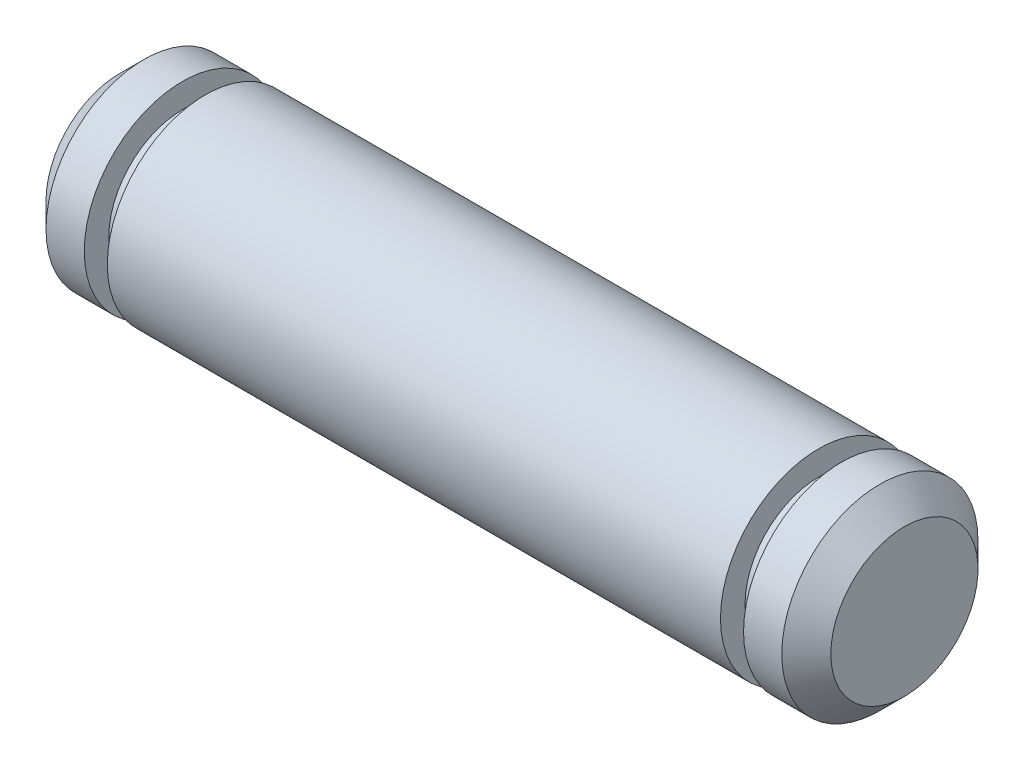
ISO-10303-21;
HEADER;
FILE_DESCRIPTION(('STEP AP214'),'2;1');
FILE_NAME('part.step','',(''),(''),'','','');
FILE_SCHEMA(('AUTOMOTIVE_DESIGN { 1 0 10303 214 1 1 1 1 }'));
ENDSEC;
DATA;
#1=APPLICATION_CONTEXT('core data for automotive mechanical design processes');
#2=APPLICATION_PROTOCOL_DEFINITION('international standard','automotive_design',2000,#1);
#3=PRODUCT_CONTEXT('',#1,'mechanical');
#4=PRODUCT('Part','Part','',(#3));
#5=PRODUCT_RELATED_PRODUCT_CATEGORY('part','',(#4));
#6=PRODUCT_DEFINITION_FORMATION('','',#4);
#7=PRODUCT_DEFINITION_CONTEXT('part definition',#1,'design');
#8=PRODUCT_DEFINITION('design','',#6,#7);
#9=PRODUCT_DEFINITION_SHAPE('','',#8);
#10=(LENGTH_UNIT() NAMED_UNIT(*) SI_UNIT(.MILLI.,.METRE.));
#11=(NAMED_UNIT(*) PLANE_ANGLE_UNIT() SI_UNIT($,.RADIAN.));
#12=(NAMED_UNIT(*) SI_UNIT($,.STERADIAN.) SOLID_ANGLE_UNIT());
#13=UNCERTAINTY_MEASURE_WITH_UNIT(LENGTH_MEASURE(1.E-05),#10,'distance_accuracy_value','');
#14=(GEOMETRIC_REPRESENTATION_CONTEXT(3) GLOBAL_UNCERTAINTY_ASSIGNED_CONTEXT((#13)) GLOBAL_UNIT_ASSIGNED_CONTEXT((#10,
#11,#12)) REPRESENTATION_CONTEXT('',''));
#15=CARTESIAN_POINT('',(0.,0.,0.));
#16=DIRECTION('',(0.,0.,1.));
#17=DIRECTION('',(1.,0.,0.));
#18=AXIS2_PLACEMENT_3D('',#15,#16,#17);
#19=CARTESIAN_POINT('',(16.,0.,0.));
#20=DIRECTION('',(-1.,0.,0.));
#21=DIRECTION('',(0.,0.,1.));
#22=AXIS2_PLACEMENT_3D('',#19,#20,#21);
#23=CYLINDRICAL_SURFACE('',#22,4.);
#24=CARTESIAN_POINT('',(12.5,0.,0.));
#25=DIRECTION('',(-1.,0.,0.));
#26=DIRECTION('',(0.,0.,1.));
#27=AXIS2_PLACEMENT_3D('',#24,#25,#26);
#28=CIRCLE('',#27,4.);
#29=CARTESIAN_POINT('',(12.5,0.,4.));
#30=VERTEX_POINT('',#29);
#31=EDGE_CURVE('E60',#30,#30,#28,.T.);
#32=ORIENTED_EDGE('',*,*,#31,.T.);
#33=EDGE_LOOP('',(#32));
#34=FACE_BOUND('',#33,.T.);
#35=CARTESIAN_POINT('',(-12.5,0.,0.));
#36=DIRECTION('',(-1.,0.,0.));
#37=DIRECTION('',(0.,0.,1.));
#38=AXIS2_PLACEMENT_3D('',#35,#36,#37);
#39=CIRCLE('',#38,4.);
#40=CARTESIAN_POINT('',(-12.5,0.,4.));
#41=VERTEX_POINT('',#40);
#42=EDGE_CURVE('E69',#41,#41,#39,.T.);
#43=ORIENTED_EDGE('',*,*,#42,.F.);
#44=EDGE_LOOP('',(#43));
#45=FACE_BOUND('',#44,.T.);
#46=ADVANCED_FACE('F31',(#34,#45),#23,.T.);
#47=CARTESIAN_POINT('',(12.5,4.,0.));
#48=DIRECTION('',(1.,0.,0.));
#49=DIRECTION('',(0.,0.,-1.));
#50=AXIS2_PLACEMENT_3D('',#47,#48,#49);
#51=PLANE('',#50);
#52=CARTESIAN_POINT('',(12.5,0.,0.));
#53=DIRECTION('',(-1.,0.,0.));
#54=DIRECTION('',(0.,0.,1.));
#55=AXIS2_PLACEMENT_3D('',#52,#53,#54);
#56=CIRCLE('',#55,3.);
#57=CARTESIAN_POINT('',(12.5,0.,3.));
#58=VERTEX_POINT('',#57);
#59=EDGE_CURVE('E51',#58,#58,#56,.T.);
#60=ORIENTED_EDGE('',*,*,#59,.T.);
#61=EDGE_LOOP('',(#60));
#62=FACE_BOUND('',#61,.T.);
#63=ORIENTED_EDGE('',*,*,#31,.F.);
#64=EDGE_LOOP('',(#63));
#65=FACE_BOUND('',#64,.T.);
#66=ADVANCED_FACE('F94',(#62,#65),#51,.T.);
#67=CARTESIAN_POINT('',(16.,0.,0.));
#68=DIRECTION('',(-1.,0.,0.));
#69=DIRECTION('',(0.,0.,1.));
#70=AXIS2_PLACEMENT_3D('',#67,#68,#69);
#71=CYLINDRICAL_SURFACE('',#70,3.);
#72=CARTESIAN_POINT('',(13.44,0.,0.));
#73=DIRECTION('',(-1.,0.,0.));
#74=DIRECTION('',(0.,0.,1.));
#75=AXIS2_PLACEMENT_3D('',#72,#73,#74);
#76=CIRCLE('',#75,3.);
#77=CARTESIAN_POINT('',(13.44,0.,3.));
#78=VERTEX_POINT('',#77);
#79=EDGE_CURVE('E54',#78,#78,#76,.T.);
#80=ORIENTED_EDGE('',*,*,#79,.T.);
#81=EDGE_LOOP('',(#80));
#82=FACE_BOUND('',#81,.T.);
#83=ORIENTED_EDGE('',*,*,#59,.F.);
#84=EDGE_LOOP('',(#83));
#85=FACE_BOUND('',#84,.T.);
#86=ADVANCED_FACE('F99',(#82,#85),#71,.T.);
#87=CARTESIAN_POINT('',(13.44,3.,0.));
#88=DIRECTION('',(-1.,0.,0.));
#89=DIRECTION('',(0.,0.,1.));
#90=AXIS2_PLACEMENT_3D('',#87,#88,#89);
#91=PLANE('',#90);
#92=CARTESIAN_POINT('',(13.44,0.,0.));
#93=DIRECTION('',(-1.,0.,0.));
#94=DIRECTION('',(0.,0.,1.));
#95=AXIS2_PLACEMENT_3D('',#92,#93,#94);
#96=CIRCLE('',#95,4.);
#97=CARTESIAN_POINT('',(13.44,0.,4.));
#98=VERTEX_POINT('',#97);
#99=EDGE_CURVE('E57',#98,#98,#96,.T.);
#100=ORIENTED_EDGE('',*,*,#99,.T.);
#101=EDGE_LOOP('',(#100));
#102=FACE_BOUND('',#101,.T.);
#103=ORIENTED_EDGE('',*,*,#79,.F.);
#104=EDGE_LOOP('',(#103));
#105=FACE_BOUND('',#104,.T.);
#106=ADVANCED_FACE('F157',(#102,#105),#91,.T.);
#107=CARTESIAN_POINT('',(16.,4.,0.));
#108=DIRECTION('',(-1.,0.,0.));
#109=DIRECTION('',(0.,0.,1.));
#110=AXIS2_PLACEMENT_3D('',#107,#108,#109);
#111=PLANE('',#110);
#112=CARTESIAN_POINT('',(16.,0.,0.));
#113=DIRECTION('',(-1.,0.,0.));
#114=DIRECTION('',(0.,0.,1.));
#115=AXIS2_PLACEMENT_3D('',#112,#113,#114);
#116=CIRCLE('',#115,3.);
#117=CARTESIAN_POINT('',(16.,0.,3.));
#118=VERTEX_POINT('',#117);
#119=EDGE_CURVE('E10',#118,#118,#116,.T.);
#120=ORIENTED_EDGE('',*,*,#119,.F.);
#121=EDGE_LOOP('',(#120));
#122=FACE_BOUND('',#121,.T.);
#123=ADVANCED_FACE('F161',(#122),#111,.F.);
#124=CARTESIAN_POINT('',(15.,0.,0.));
#125=DIRECTION('',(-1.,0.,0.));
#126=DIRECTION('',(0.,0.,1.));
#127=AXIS2_PLACEMENT_3D('',#124,#125,#126);
#128=CONICAL_SURFACE('',#127,4.,0.785398163397448);
#129=ORIENTED_EDGE('',*,*,#119,.T.);
#130=EDGE_LOOP('',(#129));
#131=FACE_BOUND('',#130,.T.);
#132=CARTESIAN_POINT('',(15.,0.,0.));
#133=DIRECTION('',(-1.,0.,0.));
#134=DIRECTION('',(0.,0.,1.));
#135=AXIS2_PLACEMENT_3D('',#132,#133,#134);
#136=CIRCLE('',#135,4.);
#137=CARTESIAN_POINT('',(15.,0.,4.));
#138=VERTEX_POINT('',#137);
#139=EDGE_CURVE('E38',#138,#138,#136,.T.);
#140=ORIENTED_EDGE('',*,*,#139,.F.);
#141=EDGE_LOOP('',(#140));
#142=FACE_BOUND('',#141,.T.);
#143=ADVANCED_FACE('F91',(#131,#142),#128,.T.);
#144=ORIENTED_EDGE('',*,*,#139,.T.);
#145=EDGE_LOOP('',(#144));
#146=FACE_BOUND('',#145,.T.);
#147=ORIENTED_EDGE('',*,*,#99,.F.);
#148=EDGE_LOOP('',(#147));
#149=FACE_BOUND('',#148,.T.);
#150=ADVANCED_FACE('F81',(#146,#149),#23,.T.);
#151=CARTESIAN_POINT('',(-13.44,4.,0.));
#152=DIRECTION('',(1.,0.,0.));
#153=DIRECTION('',(0.,0.,-1.));
#154=AXIS2_PLACEMENT_3D('',#151,#152,#153);
#155=PLANE('',#154);
#156=CARTESIAN_POINT('',(-13.44,0.,0.));
#157=DIRECTION('',(-1.,0.,0.));
#158=DIRECTION('',(0.,0.,1.));
#159=AXIS2_PLACEMENT_3D('',#156,#157,#158);
#160=CIRCLE('',#159,3.);
#161=CARTESIAN_POINT('',(-13.44,0.,3.));
#162=VERTEX_POINT('',#161);
#163=EDGE_CURVE('E63',#162,#162,#160,.T.);
#164=ORIENTED_EDGE('',*,*,#163,.T.);
#165=EDGE_LOOP('',(#164));
#166=FACE_BOUND('',#165,.T.);
#167=CARTESIAN_POINT('',(-13.44,0.,0.));
#168=DIRECTION('',(-1.,0.,0.));
#169=DIRECTION('',(0.,0.,1.));
#170=AXIS2_PLACEMENT_3D('',#167,#168,#169);
#171=CIRCLE('',#170,4.);
#172=CARTESIAN_POINT('',(-13.44,0.,4.));
#173=VERTEX_POINT('',#172);
#174=EDGE_CURVE('E72',#173,#173,#171,.T.);
#175=ORIENTED_EDGE('',*,*,#174,.F.);
#176=EDGE_LOOP('',(#175));
#177=FACE_BOUND('',#176,.T.);
#178=ADVANCED_FACE('F78',(#166,#177),#155,.T.);
#179=CARTESIAN_POINT('',(16.,0.,0.));
#180=DIRECTION('',(-1.,0.,0.));
#181=DIRECTION('',(0.,0.,1.));
#182=AXIS2_PLACEMENT_3D('',#179,#180,#181);
#183=CYLINDRICAL_SURFACE('',#182,3.);
#184=CARTESIAN_POINT('',(-12.5,0.,0.));
#185=DIRECTION('',(-1.,0.,0.));
#186=DIRECTION('',(0.,0.,1.));
#187=AXIS2_PLACEMENT_3D('',#184,#185,#186);
#188=CIRCLE('',#187,3.);
#189=CARTESIAN_POINT('',(-12.5,0.,3.));
#190=VERTEX_POINT('',#189);
#191=EDGE_CURVE('E66',#190,#190,#188,.T.);
#192=ORIENTED_EDGE('',*,*,#191,.T.);
#193=EDGE_LOOP('',(#192));
#194=FACE_BOUND('',#193,.T.);
#195=ORIENTED_EDGE('',*,*,#163,.F.);
#196=EDGE_LOOP('',(#195));
#197=FACE_BOUND('',#196,.T.);
#198=ADVANCED_FACE('F80',(#194,#197),#183,.T.);
#199=CARTESIAN_POINT('',(-12.5,3.,0.));
#200=DIRECTION('',(-1.,0.,0.));
#201=DIRECTION('',(0.,0.,1.));
#202=AXIS2_PLACEMENT_3D('',#199,#200,#201);
#203=PLANE('',#202);
#204=ORIENTED_EDGE('',*,*,#42,.T.);
#205=EDGE_LOOP('',(#204));
#206=FACE_BOUND('',#205,.T.);
#207=ORIENTED_EDGE('',*,*,#191,.F.);
#208=EDGE_LOOP('',(#207));
#209=FACE_BOUND('',#208,.T.);
#210=ADVANCED_FACE('F88',(#206,#209),#203,.T.);
#211=CARTESIAN_POINT('',(-16.,0.,0.));
#212=DIRECTION('',(1.,0.,0.));
#213=DIRECTION('',(0.,0.,-1.));
#214=AXIS2_PLACEMENT_3D('',#211,#212,#213);
#215=PLANE('',#214);
#216=CARTESIAN_POINT('',(-16.,0.,0.));
#217=DIRECTION('',(-1.,0.,0.));
#218=DIRECTION('',(0.,0.,1.));
#219=AXIS2_PLACEMENT_3D('',#216,#217,#218);
#220=CIRCLE('',#219,3.);
#221=CARTESIAN_POINT('',(-16.,0.,3.));
#222=VERTEX_POINT('',#221);
#223=EDGE_CURVE('E46',#222,#222,#220,.T.);
#224=ORIENTED_EDGE('',*,*,#223,.T.);
#225=EDGE_LOOP('',(#224));
#226=FACE_BOUND('',#225,.T.);
#227=ADVANCED_FACE('F33',(#226),#215,.F.);
#228=CARTESIAN_POINT('',(-16.,0.,0.));
#229=DIRECTION('',(1.,0.,0.));
#230=DIRECTION('',(0.,0.,-1.));
#231=AXIS2_PLACEMENT_3D('',#228,#229,#230);
#232=CONICAL_SURFACE('',#231,3.,0.785398163397448);
#233=CARTESIAN_POINT('',(-15.,0.,0.));
#234=DIRECTION('',(-1.,0.,0.));
#235=DIRECTION('',(0.,0.,1.));
#236=AXIS2_PLACEMENT_3D('',#233,#234,#235);
#237=CIRCLE('',#236,4.);
#238=CARTESIAN_POINT('',(-15.,0.,4.));
#239=VERTEX_POINT('',#238);
#240=EDGE_CURVE('E42',#239,#239,#237,.T.);
#241=ORIENTED_EDGE('',*,*,#240,.T.);
#242=EDGE_LOOP('',(#241));
#243=FACE_BOUND('',#242,.T.);
#244=ORIENTED_EDGE('',*,*,#223,.F.);
#245=EDGE_LOOP('',(#244));
#246=FACE_BOUND('',#245,.T.);
#247=ADVANCED_FACE('F105',(#243,#246),#232,.T.);
#248=ORIENTED_EDGE('',*,*,#240,.F.);
#249=EDGE_LOOP('',(#248));
#250=FACE_BOUND('',#249,.T.);
#251=ORIENTED_EDGE('',*,*,#174,.T.);
#252=EDGE_LOOP('',(#251));
#253=FACE_BOUND('',#252,.T.);
#254=ADVANCED_FACE('F76',(#250,#253),#23,.T.);
#255=CLOSED_SHELL('',(#46,#66,#86,#106,#123,#143,#150,#178,#198,#210,#227,#247,#254));
#256=MANIFOLD_SOLID_BREP('B2',#255);
#257=ADVANCED_BREP_SHAPE_REPRESENTATION('',(#18,#256),#14);
#258=SHAPE_DEFINITION_REPRESENTATION(#9,#257);
ENDSEC;
END-ISO-10303-21;
